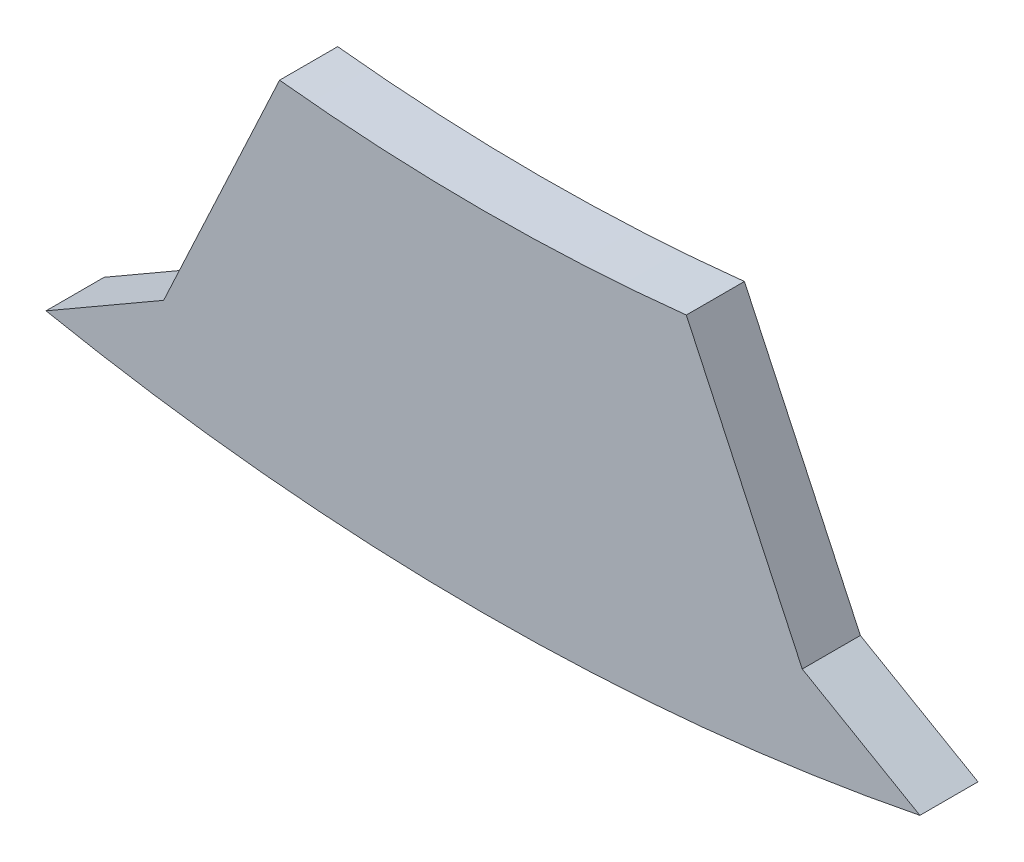
ISO-10303-21;
HEADER;
FILE_DESCRIPTION(('STEP AP214'),'2;1');
FILE_NAME('part.step','',(''),(''),'','','');
FILE_SCHEMA(('AUTOMOTIVE_DESIGN { 1 0 10303 214 1 1 1 1 }'));
ENDSEC;
DATA;
#1=APPLICATION_CONTEXT('core data for automotive mechanical design processes');
#2=APPLICATION_PROTOCOL_DEFINITION('international standard','automotive_design',2000,#1);
#3=PRODUCT_CONTEXT('',#1,'mechanical');
#4=PRODUCT('Part','Part','',(#3));
#5=PRODUCT_RELATED_PRODUCT_CATEGORY('part','',(#4));
#6=PRODUCT_DEFINITION_FORMATION('','',#4);
#7=PRODUCT_DEFINITION_CONTEXT('part definition',#1,'design');
#8=PRODUCT_DEFINITION('design','',#6,#7);
#9=PRODUCT_DEFINITION_SHAPE('','',#8);
#10=(LENGTH_UNIT() NAMED_UNIT(*) SI_UNIT(.MILLI.,.METRE.));
#11=(NAMED_UNIT(*) PLANE_ANGLE_UNIT() SI_UNIT($,.RADIAN.));
#12=(NAMED_UNIT(*) SI_UNIT($,.STERADIAN.) SOLID_ANGLE_UNIT());
#13=UNCERTAINTY_MEASURE_WITH_UNIT(LENGTH_MEASURE(1.E-05),#10,'distance_accuracy_value','');
#14=(GEOMETRIC_REPRESENTATION_CONTEXT(3) GLOBAL_UNCERTAINTY_ASSIGNED_CONTEXT((#13)) GLOBAL_UNIT_ASSIGNED_CONTEXT((#10,
#11,#12)) REPRESENTATION_CONTEXT('',''));
#15=CARTESIAN_POINT('',(0.,0.,0.));
#16=DIRECTION('',(0.,0.,1.));
#17=DIRECTION('',(1.,0.,0.));
#18=AXIS2_PLACEMENT_3D('',#15,#16,#17);
#19=CARTESIAN_POINT('',(-5.33032071265637,-36.5636373549049,0.985));
#20=DIRECTION('',(0.499999999999995,-0.866025403784441,0.));
#21=DIRECTION('',(0.866025403784441,0.499999999999995,0.));
#22=AXIS2_PLACEMENT_3D('',#19,#20,#21);
#23=PLANE('',#22);
#24=DIRECTION('',(-0.866025403784441,-0.499999999999995,0.));
#25=VECTOR('',#24,1.);
#26=CARTESIAN_POINT('',(-5.33032071265637,-36.5636373549049,0.0150000000000001));
#27=LINE('',#26,#25);
#28=CARTESIAN_POINT('',(-5.33032071265637,-36.5636373549049,0.0150000000000001));
#29=VERTEX_POINT('',#28);
#30=CARTESIAN_POINT('',(-7.29408422567675,-37.697416747772,0.0150000000000001));
#31=VERTEX_POINT('',#30);
#32=EDGE_CURVE('E126',#29,#31,#27,.T.);
#33=ORIENTED_EDGE('',*,*,#32,.T.);
#34=DIRECTION('',(0.,0.,-1.));
#35=VECTOR('',#34,1.);
#36=CARTESIAN_POINT('',(-7.29408422567675,-37.697416747772,0.985));
#37=LINE('',#36,#35);
#38=CARTESIAN_POINT('',(-7.29408422567675,-37.697416747772,0.985));
#39=VERTEX_POINT('',#38);
#40=EDGE_CURVE('E12',#39,#31,#37,.T.);
#41=ORIENTED_EDGE('',*,*,#40,.F.);
#42=DIRECTION('',(-0.866025403784441,-0.499999999999995,0.));
#43=VECTOR('',#42,1.);
#44=CARTESIAN_POINT('',(-5.33032071265637,-36.5636373549049,0.985));
#45=LINE('',#44,#43);
#46=CARTESIAN_POINT('',(-5.33032071265637,-36.5636373549049,0.985));
#47=VERTEX_POINT('',#46);
#48=EDGE_CURVE('E136',#47,#39,#45,.T.);
#49=ORIENTED_EDGE('',*,*,#48,.F.);
#50=DIRECTION('',(0.,0.,-1.));
#51=VECTOR('',#50,1.);
#52=CARTESIAN_POINT('',(-5.33032071265637,-36.5636373549049,0.985));
#53=LINE('',#52,#51);
#54=EDGE_CURVE('E122',#47,#29,#53,.T.);
#55=ORIENTED_EDGE('',*,*,#54,.T.);
#56=EDGE_LOOP('',(#33,#41,#49,#55));
#57=FACE_BOUND('',#56,.T.);
#58=ADVANCED_FACE('F42',(#57),#23,.F.);
#59=CARTESIAN_POINT('',(0.,-1.07166951568495,0.985));
#60=DIRECTION('',(0.,0.,-1.));
#61=DIRECTION('',(-1.,0.,0.));
#62=AXIS2_PLACEMENT_3D('',#59,#60,#61);
#63=CYLINDRICAL_SURFACE('',#62,37.345);
#64=CARTESIAN_POINT('',(0.,-1.07166951568495,0.0150000000000001));
#65=DIRECTION('',(0.,0.,1.));
#66=DIRECTION('',(1.,0.,0.));
#67=AXIS2_PLACEMENT_3D('',#64,#65,#66);
#68=CIRCLE('',#67,37.345);
#69=CARTESIAN_POINT('',(7.29408422567677,-37.697416747772,0.0150000000000001));
#70=VERTEX_POINT('',#69);
#71=EDGE_CURVE('E129',#31,#70,#68,.T.);
#72=ORIENTED_EDGE('',*,*,#71,.T.);
#73=DIRECTION('',(0.,0.,-1.));
#74=VECTOR('',#73,1.);
#75=CARTESIAN_POINT('',(7.29408422567677,-37.697416747772,0.985));
#76=LINE('',#75,#74);
#77=CARTESIAN_POINT('',(7.29408422567677,-37.697416747772,0.985));
#78=VERTEX_POINT('',#77);
#79=EDGE_CURVE('E50',#78,#70,#76,.T.);
#80=ORIENTED_EDGE('',*,*,#79,.F.);
#81=CARTESIAN_POINT('',(0.,-1.07166951568495,0.985));
#82=DIRECTION('',(0.,0.,1.));
#83=DIRECTION('',(1.,0.,0.));
#84=AXIS2_PLACEMENT_3D('',#81,#82,#83);
#85=CIRCLE('',#84,37.345);
#86=EDGE_CURVE('E95',#39,#78,#85,.T.);
#87=ORIENTED_EDGE('',*,*,#86,.F.);
#88=ORIENTED_EDGE('',*,*,#40,.T.);
#89=EDGE_LOOP('',(#72,#80,#87,#88));
#90=FACE_BOUND('',#89,.T.);
#91=ADVANCED_FACE('F160',(#90),#63,.T.);
#92=CARTESIAN_POINT('',(5.33032071265638,-36.5636373549049,0.985));
#93=DIRECTION('',(-0.499999999999995,-0.866025403784441,0.));
#94=DIRECTION('',(0.866025403784441,-0.499999999999995,0.));
#95=AXIS2_PLACEMENT_3D('',#92,#93,#94);
#96=PLANE('',#95);
#97=DIRECTION('',(-0.866025403784441,0.499999999999995,0.));
#98=VECTOR('',#97,1.);
#99=CARTESIAN_POINT('',(5.33032071265638,-36.5636373549049,0.0150000000000001));
#100=LINE('',#99,#98);
#101=CARTESIAN_POINT('',(5.33032071265638,-36.5636373549049,0.0150000000000001));
#102=VERTEX_POINT('',#101);
#103=EDGE_CURVE('E131',#70,#102,#100,.T.);
#104=ORIENTED_EDGE('',*,*,#103,.T.);
#105=DIRECTION('',(0.,0.,-1.));
#106=VECTOR('',#105,1.);
#107=CARTESIAN_POINT('',(5.33032071265638,-36.5636373549049,0.985));
#108=LINE('',#107,#106);
#109=CARTESIAN_POINT('',(5.33032071265638,-36.5636373549049,0.985));
#110=VERTEX_POINT('',#109);
#111=EDGE_CURVE('E117',#110,#102,#108,.T.);
#112=ORIENTED_EDGE('',*,*,#111,.F.);
#113=DIRECTION('',(-0.866025403784441,0.499999999999995,0.));
#114=VECTOR('',#113,1.);
#115=CARTESIAN_POINT('',(5.33032071265638,-36.5636373549049,0.985));
#116=LINE('',#115,#114);
#117=EDGE_CURVE('E108',#78,#110,#116,.T.);
#118=ORIENTED_EDGE('',*,*,#117,.F.);
#119=ORIENTED_EDGE('',*,*,#79,.T.);
#120=EDGE_LOOP('',(#104,#112,#118,#119));
#121=FACE_BOUND('',#120,.T.);
#122=ADVANCED_FACE('F142',(#121),#96,.F.);
#123=CARTESIAN_POINT('',(5.33032071265638,-36.5636373549049,0.985));
#124=DIRECTION('',(-0.906307787036653,-0.422618261740692,0.));
#125=DIRECTION('',(0.422618261740692,-0.906307787036653,0.));
#126=AXIS2_PLACEMENT_3D('',#123,#124,#125);
#127=PLANE('',#126);
#128=DIRECTION('',(-0.422618261740692,0.906307787036653,0.));
#129=VECTOR('',#128,1.);
#130=CARTESIAN_POINT('',(5.33032071265638,-36.5636373549049,0.0150000000000001));
#131=LINE('',#130,#129);
#132=CARTESIAN_POINT('',(3.39499999999998,-32.4133286932078,0.0150000000000001));
#133=VERTEX_POINT('',#132);
#134=EDGE_CURVE('E116',#102,#133,#131,.T.);
#135=ORIENTED_EDGE('',*,*,#134,.T.);
#136=DIRECTION('',(0.,0.,-1.));
#137=VECTOR('',#136,1.);
#138=CARTESIAN_POINT('',(3.39499999999998,-32.4133286932078,0.985));
#139=LINE('',#138,#137);
#140=CARTESIAN_POINT('',(3.39499999999998,-32.4133286932078,0.985));
#141=VERTEX_POINT('',#140);
#142=EDGE_CURVE('E113',#141,#133,#139,.T.);
#143=ORIENTED_EDGE('',*,*,#142,.F.);
#144=DIRECTION('',(-0.422618261740692,0.906307787036653,0.));
#145=VECTOR('',#144,1.);
#146=CARTESIAN_POINT('',(5.33032071265638,-36.5636373549049,0.985));
#147=LINE('',#146,#145);
#148=EDGE_CURVE('E102',#110,#141,#147,.T.);
#149=ORIENTED_EDGE('',*,*,#148,.F.);
#150=ORIENTED_EDGE('',*,*,#111,.T.);
#151=EDGE_LOOP('',(#135,#143,#149,#150));
#152=FACE_BOUND('',#151,.T.);
#153=ADVANCED_FACE('F114',(#152),#127,.F.);
#154=CARTESIAN_POINT('',(0.,-1.07166951568495,0.985));
#155=DIRECTION('',(0.,0.,-1.));
#156=DIRECTION('',(-1.,0.,0.));
#157=AXIS2_PLACEMENT_3D('',#154,#155,#156);
#158=CYLINDRICAL_SURFACE('',#157,31.525);
#159=CARTESIAN_POINT('',(0.,-1.07166951568495,0.0150000000000001));
#160=DIRECTION('',(0.,0.,-1.));
#161=DIRECTION('',(1.,0.,0.));
#162=AXIS2_PLACEMENT_3D('',#159,#160,#161);
#163=CIRCLE('',#162,31.525);
#164=CARTESIAN_POINT('',(-3.395,-32.4133286932078,0.0150000000000001));
#165=VERTEX_POINT('',#164);
#166=EDGE_CURVE('E81',#133,#165,#163,.T.);
#167=ORIENTED_EDGE('',*,*,#166,.T.);
#168=DIRECTION('',(0.,0.,-1.));
#169=VECTOR('',#168,1.);
#170=CARTESIAN_POINT('',(-3.395,-32.4133286932078,0.985));
#171=LINE('',#170,#169);
#172=CARTESIAN_POINT('',(-3.395,-32.4133286932078,0.985));
#173=VERTEX_POINT('',#172);
#174=EDGE_CURVE('E118',#173,#165,#171,.T.);
#175=ORIENTED_EDGE('',*,*,#174,.F.);
#176=CARTESIAN_POINT('',(0.,-1.07166951568495,0.985));
#177=DIRECTION('',(0.,0.,-1.));
#178=DIRECTION('',(1.,0.,0.));
#179=AXIS2_PLACEMENT_3D('',#176,#177,#178);
#180=CIRCLE('',#179,31.525);
#181=EDGE_CURVE('E106',#141,#173,#180,.T.);
#182=ORIENTED_EDGE('',*,*,#181,.F.);
#183=ORIENTED_EDGE('',*,*,#142,.T.);
#184=EDGE_LOOP('',(#167,#175,#182,#183));
#185=FACE_BOUND('',#184,.T.);
#186=ADVANCED_FACE('F120',(#185),#158,.F.);
#187=CARTESIAN_POINT('',(-5.33032071265637,-36.5636373549049,0.985));
#188=DIRECTION('',(0.906307787036653,-0.422618261740692,0.));
#189=DIRECTION('',(0.422618261740692,0.906307787036654,0.));
#190=AXIS2_PLACEMENT_3D('',#187,#188,#189);
#191=PLANE('',#190);
#192=DIRECTION('',(-0.422618261740692,-0.906307787036653,0.));
#193=VECTOR('',#192,1.);
#194=CARTESIAN_POINT('',(-5.33032071265637,-36.5636373549049,0.0150000000000001));
#195=LINE('',#194,#193);
#196=EDGE_CURVE('E87',#165,#29,#195,.T.);
#197=ORIENTED_EDGE('',*,*,#196,.T.);
#198=ORIENTED_EDGE('',*,*,#54,.F.);
#199=DIRECTION('',(-0.422618261740692,-0.906307787036653,0.));
#200=VECTOR('',#199,1.);
#201=CARTESIAN_POINT('',(-5.33032071265637,-36.5636373549049,0.985));
#202=LINE('',#201,#200);
#203=EDGE_CURVE('E58',#173,#47,#202,.T.);
#204=ORIENTED_EDGE('',*,*,#203,.F.);
#205=ORIENTED_EDGE('',*,*,#174,.T.);
#206=EDGE_LOOP('',(#197,#198,#204,#205));
#207=FACE_BOUND('',#206,.T.);
#208=ADVANCED_FACE('F149',(#207),#191,.F.);
#209=CARTESIAN_POINT('',(0.,-1.07166951568495,0.985));
#210=DIRECTION('',(0.,0.,1.));
#211=DIRECTION('',(1.,0.,0.));
#212=AXIS2_PLACEMENT_3D('',#209,#210,#211);
#213=PLANE('',#212);
#214=ORIENTED_EDGE('',*,*,#48,.T.);
#215=ORIENTED_EDGE('',*,*,#86,.T.);
#216=ORIENTED_EDGE('',*,*,#117,.T.);
#217=ORIENTED_EDGE('',*,*,#148,.T.);
#218=ORIENTED_EDGE('',*,*,#181,.T.);
#219=ORIENTED_EDGE('',*,*,#203,.T.);
#220=EDGE_LOOP('',(#214,#215,#216,#217,#218,#219));
#221=FACE_BOUND('',#220,.T.);
#222=ADVANCED_FACE('F104',(#221),#213,.T.);
#223=CARTESIAN_POINT('',(0.,-1.07166951568495,0.0150000000000001));
#224=DIRECTION('',(0.,0.,1.));
#225=DIRECTION('',(1.,0.,0.));
#226=AXIS2_PLACEMENT_3D('',#223,#224,#225);
#227=PLANE('',#226);
#228=ORIENTED_EDGE('',*,*,#32,.F.);
#229=ORIENTED_EDGE('',*,*,#196,.F.);
#230=ORIENTED_EDGE('',*,*,#166,.F.);
#231=ORIENTED_EDGE('',*,*,#134,.F.);
#232=ORIENTED_EDGE('',*,*,#103,.F.);
#233=ORIENTED_EDGE('',*,*,#71,.F.);
#234=EDGE_LOOP('',(#228,#229,#230,#231,#232,#233));
#235=FACE_BOUND('',#234,.T.);
#236=ADVANCED_FACE('F145',(#235),#227,.F.);
#237=CLOSED_SHELL('',(#58,#91,#122,#153,#186,#208,#222,#236));
#238=MANIFOLD_SOLID_BREP('B2',#237);
#239=ADVANCED_BREP_SHAPE_REPRESENTATION('',(#18,#238),#14);
#240=SHAPE_DEFINITION_REPRESENTATION(#9,#239);
ENDSEC;
END-ISO-10303-21;
